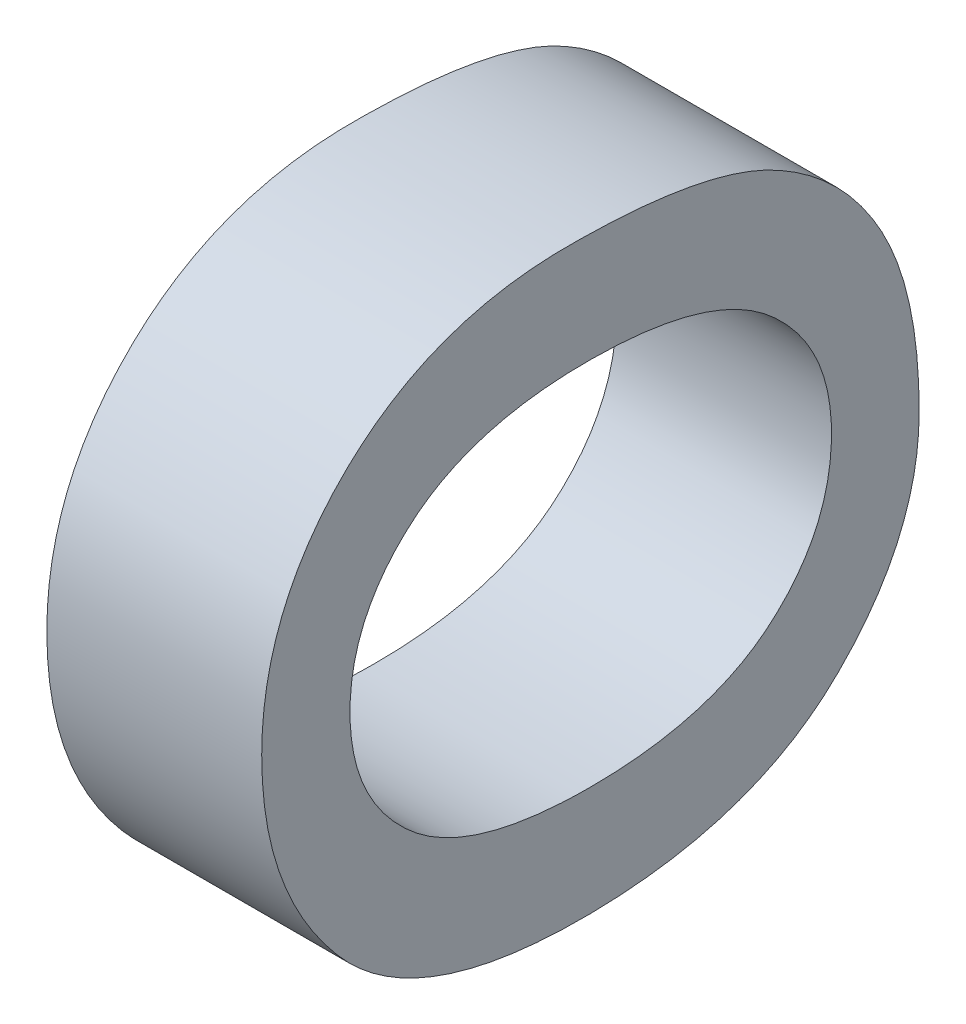
ISO-10303-21;
HEADER;
FILE_DESCRIPTION(('STEP AP214'),'2;1');
FILE_NAME('part.step','',(''),(''),'','','');
FILE_SCHEMA(('AUTOMOTIVE_DESIGN { 1 0 10303 214 1 1 1 1 }'));
ENDSEC;
DATA;
#1=APPLICATION_CONTEXT('core data for automotive mechanical design processes');
#2=APPLICATION_PROTOCOL_DEFINITION('international standard','automotive_design',2000,#1);
#3=PRODUCT_CONTEXT('',#1,'mechanical');
#4=PRODUCT('Part','Part','',(#3));
#5=PRODUCT_RELATED_PRODUCT_CATEGORY('part','',(#4));
#6=PRODUCT_DEFINITION_FORMATION('','',#4);
#7=PRODUCT_DEFINITION_CONTEXT('part definition',#1,'design');
#8=PRODUCT_DEFINITION('design','',#6,#7);
#9=PRODUCT_DEFINITION_SHAPE('','',#8);
#10=(LENGTH_UNIT() NAMED_UNIT(*) SI_UNIT(.MILLI.,.METRE.));
#11=(NAMED_UNIT(*) PLANE_ANGLE_UNIT() SI_UNIT($,.RADIAN.));
#12=(NAMED_UNIT(*) SI_UNIT($,.STERADIAN.) SOLID_ANGLE_UNIT());
#13=UNCERTAINTY_MEASURE_WITH_UNIT(LENGTH_MEASURE(1.E-05),#10,'distance_accuracy_value','');
#14=(GEOMETRIC_REPRESENTATION_CONTEXT(3) GLOBAL_UNCERTAINTY_ASSIGNED_CONTEXT((#13)) GLOBAL_UNIT_ASSIGNED_CONTEXT((#10,
#11,#12)) REPRESENTATION_CONTEXT('',''));
#15=CARTESIAN_POINT('',(0.,0.,0.));
#16=DIRECTION('',(0.,0.,1.));
#17=DIRECTION('',(1.,0.,0.));
#18=AXIS2_PLACEMENT_3D('',#15,#16,#17);
#19=CARTESIAN_POINT('',(4.55229940712905,-38.7923037867198,-8.87455840971013));
#20=DIRECTION('',(-1.,0.,0.));
#21=DIRECTION('',(0.,0.,1.));
#22=AXIS2_PLACEMENT_3D('',#19,#20,#21);
#23=PLANE('',#22);
#24=CARTESIAN_POINT('',(4.55229940712904,-38.7070234674718,-9.06579306499374));
#25=CARTESIAN_POINT('',(4.55229940712904,-38.7070234674718,-9.1220263906555));
#26=CARTESIAN_POINT('',(4.55229940712904,-38.682490300884,-9.15000522670781));
#27=CARTESIAN_POINT('',(4.55229940712904,-38.6579571342963,-9.17798406276011));
#28=CARTESIAN_POINT('',(4.55229940712903,-38.6207439040789,-9.17798406276011));
#29=CARTESIAN_POINT('',(4.55229940712903,-38.5838063274188,-9.17798406276011));
#30=CARTESIAN_POINT('',(4.55229940712902,-38.559273160831,-9.14986739992922));
#31=CARTESIAN_POINT('',(4.55229940712902,-38.5347399942433,-9.12175073709834));
#32=CARTESIAN_POINT('',(4.55229940712902,-38.5347399942433,-9.06413914365074));
#33=CARTESIAN_POINT('',(4.55229940712902,-38.5347399942433,-9.00983539288913));
#34=CARTESIAN_POINT('',(4.55229940712902,-38.5594109876096,-8.98185655683683));
#35=CARTESIAN_POINT('',(4.55229940712903,-38.5840819809759,-8.95387772078453));
#36=CARTESIAN_POINT('',(4.55229940712903,-38.6207439040789,-8.95387772078453));
#37=CARTESIAN_POINT('',(4.55229940712904,-38.6579571342963,-8.95387772078453));
#38=CARTESIAN_POINT('',(4.55229940712904,-38.682490300884,-8.98171873005825));
#39=CARTESIAN_POINT('',(4.55229940712904,-38.7070234674718,-9.00955973933197));
#40=CARTESIAN_POINT('',(4.55229940712904,-38.7070234674718,-9.06579306499374));
#41=(BOUNDED_CURVE() B_SPLINE_CURVE(2,(#24,#25,#26,#27,#28,#29,#30,#31,#32,#33,#34,#35,#36,#37,
#38,#39,#40),.UNSPECIFIED.,.T.,.F.) B_SPLINE_CURVE_WITH_KNOTS((3,2,2,2,2,2,2,2,3),(9.,10.,11.,
12.,13.,14.,15.,16.,17.),
.UNSPECIFIED.) CURVE() GEOMETRIC_REPRESENTATION_ITEM() RATIONAL_B_SPLINE_CURVE((1.,1.,1.,1.,1.,
1.,1.,1.,1.,1.,1.,1.,1.,1.,1.,1.,1.)) REPRESENTATION_ITEM(''));
#42=CARTESIAN_POINT('',(4.55229940712904,-38.7070234674718,-9.06579306499374));
#43=VERTEX_POINT('',#42);
#44=EDGE_CURVE('E11',#43,#43,#41,.T.);
#45=ORIENTED_EDGE('',*,*,#44,.T.);
#46=EDGE_LOOP('',(#45));
#47=FACE_BOUND('',#46,.T.);
#48=CARTESIAN_POINT('',(4.55229940712905,-38.7580193755474,-9.06220956875058));
#49=CARTESIAN_POINT('',(4.55229940712905,-38.7580193755474,-8.9844752656299));
#50=CARTESIAN_POINT('',(4.55229940712904,-38.6750476548406,-8.91280534076686));
#51=CARTESIAN_POINT('',(4.55229940712902,-38.5603757750597,-8.91280534076686));
#52=CARTESIAN_POINT('',(4.55229940712901,-38.4837440861677,-8.99191791167337));
#53=CARTESIAN_POINT('',(4.55229940712901,-38.4837440861677,-9.11816724085519));
#54=CARTESIAN_POINT('',(4.55229940712902,-38.517649473699,-9.18294582678909));
#55=CARTESIAN_POINT('',(4.55229940712903,-38.582428059633,-9.21878078922061));
#56=CARTESIAN_POINT('',(4.55229940712904,-38.6822146473269,-9.21878078922061));
#57=CARTESIAN_POINT('',(4.55229940712905,-38.7580193755474,-9.13994387187126));
#58=CARTESIAN_POINT('',(4.55229940712905,-38.7580193755474,-9.06220956875058));
#59=(BOUNDED_CURVE() B_SPLINE_CURVE(2,(#48,#49,#50,#51,#52,#53,#54,#55,#56,#57,#58),
.UNSPECIFIED.,.T.,.F.) B_SPLINE_CURVE_WITH_KNOTS((3,1,1,1,1,1,1,1,1,3),(0.,1.,2.,3.,4.,5.,6.,7.,
8.,9.),.UNSPECIFIED.) CURVE() GEOMETRIC_REPRESENTATION_ITEM() RATIONAL_B_SPLINE_CURVE((1.,1.,1.,
1.,1.,1.,1.,1.,1.,1.,1.)) REPRESENTATION_ITEM(''));
#60=CARTESIAN_POINT('',(4.55229940712905,-38.7580193755474,-9.06579306499374));
#61=VERTEX_POINT('',#60);
#62=EDGE_CURVE('E57',#61,#61,#59,.T.);
#63=ORIENTED_EDGE('',*,*,#62,.T.);
#64=EDGE_LOOP('',(#63));
#65=FACE_BOUND('',#64,.T.);
#66=ADVANCED_FACE('F16',(#47,#65),#23,.T.);
#67=CARTESIAN_POINT('',(4.65229940712906,-38.7923037867198,-8.87455840971013));
#68=DIRECTION('',(1.,0.,0.));
#69=DIRECTION('',(0.,1.,0.));
#70=AXIS2_PLACEMENT_3D('',#67,#68,#69);
#71=PLANE('',#70);
#72=CARTESIAN_POINT('',(4.65229940712905,-38.7070234674717,-9.06579306499374));
#73=CARTESIAN_POINT('',(4.65229940712905,-38.7070234674717,-9.1220263906555));
#74=CARTESIAN_POINT('',(4.65229940712904,-38.682490300884,-9.15000522670781));
#75=CARTESIAN_POINT('',(4.65229940712904,-38.6579571342963,-9.17798406276011));
#76=CARTESIAN_POINT('',(4.65229940712903,-38.6207439040789,-9.17798406276011));
#77=CARTESIAN_POINT('',(4.65229940712903,-38.5838063274188,-9.17798406276011));
#78=CARTESIAN_POINT('',(4.65229940712903,-38.559273160831,-9.14986739992922));
#79=CARTESIAN_POINT('',(4.65229940712902,-38.5347399942433,-9.12175073709834));
#80=CARTESIAN_POINT('',(4.65229940712902,-38.5347399942433,-9.06413914365075));
#81=CARTESIAN_POINT('',(4.65229940712902,-38.5347399942433,-9.00983539288913));
#82=CARTESIAN_POINT('',(4.65229940712902,-38.5594109876096,-8.98185655683683));
#83=CARTESIAN_POINT('',(4.65229940712903,-38.5840819809759,-8.95387772078453));
#84=CARTESIAN_POINT('',(4.65229940712903,-38.6207439040789,-8.95387772078453));
#85=CARTESIAN_POINT('',(4.65229940712904,-38.6579571342963,-8.95387772078453));
#86=CARTESIAN_POINT('',(4.65229940712904,-38.682490300884,-8.98171873005825));
#87=CARTESIAN_POINT('',(4.65229940712904,-38.7070234674717,-9.00955973933197));
#88=CARTESIAN_POINT('',(4.65229940712905,-38.7070234674717,-9.06579306499374));
#89=(BOUNDED_CURVE() B_SPLINE_CURVE(2,(#72,#73,#74,#75,#76,#77,#78,#79,#80,#81,#82,#83,#84,#85,
#86,#87,#88),.UNSPECIFIED.,.T.,.F.) B_SPLINE_CURVE_WITH_KNOTS((3,2,2,2,2,2,2,2,3),(9.,10.,11.,
12.,13.,14.,15.,16.,17.),
.UNSPECIFIED.) CURVE() GEOMETRIC_REPRESENTATION_ITEM() RATIONAL_B_SPLINE_CURVE((1.,1.,1.,1.,1.,
1.,1.,1.,1.,1.,1.,1.,1.,1.,1.,1.,1.)) REPRESENTATION_ITEM(''));
#90=CARTESIAN_POINT('',(4.65229940712905,-38.7070234674717,-9.06579306499374));
#91=VERTEX_POINT('',#90);
#92=EDGE_CURVE('E59',#91,#91,#89,.T.);
#93=ORIENTED_EDGE('',*,*,#92,.F.);
#94=EDGE_LOOP('',(#93));
#95=FACE_BOUND('',#94,.T.);
#96=CARTESIAN_POINT('',(4.65229940712905,-38.7580193755474,-9.06220956875059));
#97=CARTESIAN_POINT('',(4.65229940712905,-38.7580193755474,-8.9844752656299));
#98=CARTESIAN_POINT('',(4.65229940712904,-38.6750476548405,-8.91280534076686));
#99=CARTESIAN_POINT('',(4.65229940712902,-38.5603757750597,-8.91280534076686));
#100=CARTESIAN_POINT('',(4.65229940712901,-38.4837440861677,-8.99191791167338));
#101=CARTESIAN_POINT('',(4.65229940712901,-38.4837440861677,-9.11816724085519));
#102=CARTESIAN_POINT('',(4.65229940712902,-38.517649473699,-9.18294582678909));
#103=CARTESIAN_POINT('',(4.65229940712903,-38.5824280596329,-9.21878078922061));
#104=CARTESIAN_POINT('',(4.65229940712904,-38.6822146473268,-9.21878078922061));
#105=CARTESIAN_POINT('',(4.65229940712905,-38.7580193755474,-9.13994387187127));
#106=CARTESIAN_POINT('',(4.65229940712905,-38.7580193755474,-9.06220956875059));
#107=(BOUNDED_CURVE() B_SPLINE_CURVE(2,(#96,#97,#98,#99,#100,#101,#102,#103,#104,#105,#106),
.UNSPECIFIED.,.T.,.F.) B_SPLINE_CURVE_WITH_KNOTS((3,1,1,1,1,1,1,1,1,3),(0.,1.,2.,3.,4.,5.,6.,7.,
8.,9.),.UNSPECIFIED.) CURVE() GEOMETRIC_REPRESENTATION_ITEM() RATIONAL_B_SPLINE_CURVE((1.,1.,1.,
1.,1.,1.,1.,1.,1.,1.,1.)) REPRESENTATION_ITEM(''));
#108=CARTESIAN_POINT('',(4.65229940712905,-38.7580193755474,-9.06579306499374));
#109=VERTEX_POINT('',#108);
#110=EDGE_CURVE('E66',#109,#109,#107,.T.);
#111=ORIENTED_EDGE('',*,*,#110,.F.);
#112=EDGE_LOOP('',(#111));
#113=FACE_BOUND('',#112,.T.);
#114=ADVANCED_FACE('F97',(#95,#113),#71,.T.);
#115=CARTESIAN_POINT('',(4.65229940712905,-38.7070234674717,-9.06579306499374));
#116=CARTESIAN_POINT('',(4.55229940712904,-38.7070234674718,-9.06579306499374));
#117=CARTESIAN_POINT('',(4.65229940712905,-38.7070234674717,-9.1220263906555));
#118=CARTESIAN_POINT('',(4.55229940712904,-38.7070234674718,-9.1220263906555));
#119=CARTESIAN_POINT('',(4.65229940712904,-38.682490300884,-9.15000522670781));
#120=CARTESIAN_POINT('',(4.55229940712904,-38.682490300884,-9.15000522670781));
#121=CARTESIAN_POINT('',(4.65229940712904,-38.6579571342963,-9.17798406276011));
#122=CARTESIAN_POINT('',(4.55229940712904,-38.6579571342963,-9.17798406276011));
#123=CARTESIAN_POINT('',(4.65229940712903,-38.6207439040789,-9.17798406276011));
#124=CARTESIAN_POINT('',(4.55229940712903,-38.6207439040789,-9.17798406276011));
#125=CARTESIAN_POINT('',(4.65229940712903,-38.5838063274188,-9.17798406276011));
#126=CARTESIAN_POINT('',(4.55229940712903,-38.5838063274188,-9.17798406276011));
#127=CARTESIAN_POINT('',(4.65229940712903,-38.559273160831,-9.14986739992922));
#128=CARTESIAN_POINT('',(4.55229940712902,-38.559273160831,-9.14986739992922));
#129=CARTESIAN_POINT('',(4.65229940712902,-38.5347399942433,-9.12175073709834));
#130=CARTESIAN_POINT('',(4.55229940712902,-38.5347399942433,-9.12175073709834));
#131=CARTESIAN_POINT('',(4.65229940712902,-38.5347399942433,-9.06413914365075));
#132=CARTESIAN_POINT('',(4.55229940712902,-38.5347399942433,-9.06413914365074));
#133=CARTESIAN_POINT('',(4.65229940712902,-38.5347399942433,-9.00983539288913));
#134=CARTESIAN_POINT('',(4.55229940712902,-38.5347399942433,-9.00983539288913));
#135=CARTESIAN_POINT('',(4.65229940712902,-38.5594109876096,-8.98185655683683));
#136=CARTESIAN_POINT('',(4.55229940712902,-38.5594109876096,-8.98185655683683));
#137=CARTESIAN_POINT('',(4.65229940712903,-38.5840819809759,-8.95387772078453));
#138=CARTESIAN_POINT('',(4.55229940712903,-38.5840819809759,-8.95387772078453));
#139=CARTESIAN_POINT('',(4.65229940712903,-38.6207439040789,-8.95387772078453));
#140=CARTESIAN_POINT('',(4.55229940712903,-38.6207439040789,-8.95387772078453));
#141=CARTESIAN_POINT('',(4.65229940712904,-38.6579571342963,-8.95387772078453));
#142=CARTESIAN_POINT('',(4.55229940712904,-38.6579571342963,-8.95387772078453));
#143=CARTESIAN_POINT('',(4.65229940712904,-38.682490300884,-8.98171873005825));
#144=CARTESIAN_POINT('',(4.55229940712904,-38.682490300884,-8.98171873005825));
#145=CARTESIAN_POINT('',(4.65229940712904,-38.7070234674717,-9.00955973933197));
#146=CARTESIAN_POINT('',(4.55229940712904,-38.7070234674718,-9.00955973933197));
#147=CARTESIAN_POINT('',(4.65229940712905,-38.7070234674717,-9.06579306499374));
#148=CARTESIAN_POINT('',(4.55229940712904,-38.7070234674718,-9.06579306499374));
#149=(BOUNDED_SURFACE() B_SPLINE_SURFACE(2,1,((#115,#116),(#117,#118),(#119,#120),(#121,#122),
(#123,#124),(#125,#126),(#127,#128),(#129,#130),(#131,#132),(#133,#134),(#135,#136),(#137,#138),
(#139,#140),(#141,#142),(#143,#144),(#145,#146),(#147,#148)),.UNSPECIFIED.,.T.,.F.,
.F.) B_SPLINE_SURFACE_WITH_KNOTS((3,2,2,2,2,2,2,2,3),(2,2),(9.,10.,11.,12.,13.,14.,15.,16.,17.),
(0.,0.1),.UNSPECIFIED.) GEOMETRIC_REPRESENTATION_ITEM() RATIONAL_B_SPLINE_SURFACE(((1.,1.),(1.,
1.),(1.,1.),(1.,1.),(1.,1.),(1.,1.),(1.,1.),(1.,1.),(1.,1.),(1.,1.),(1.,1.),(1.,1.),(1.,1.),(1.,
1.),(1.,1.),(1.,1.),(1.,1.))) REPRESENTATION_ITEM('') SURFACE());
#150=CARTESIAN_POINT('',(4.65229940712905,-38.7070234674717,-9.06579306499374));
#151=CARTESIAN_POINT('',(4.55229940712904,-38.7070234674718,-9.06579306499374));
#152=(BOUNDED_CURVE() B_SPLINE_CURVE(1,(#150,#151),.UNSPECIFIED.,.F.,
.F.) B_SPLINE_CURVE_WITH_KNOTS((2,2),(0.,0.1),
.UNSPECIFIED.) CURVE() GEOMETRIC_REPRESENTATION_ITEM() RATIONAL_B_SPLINE_CURVE((1.,1.)) REPRESENTATION_ITEM(''));
#153=EDGE_CURVE('E31',#91,#43,#152,.T.);
#154=ORIENTED_EDGE('',*,*,#92,.T.);
#155=ORIENTED_EDGE('',*,*,#153,.T.);
#156=ORIENTED_EDGE('',*,*,#44,.F.);
#157=ORIENTED_EDGE('',*,*,#153,.F.);
#158=EDGE_LOOP('',(#154,#155,#156,#157));
#159=FACE_BOUND('',#158,.T.);
#160=ADVANCED_FACE('F99',(#159),#149,.T.);
#161=CARTESIAN_POINT('',(4.65229940712905,-38.7580193755474,-9.06220956875059));
#162=CARTESIAN_POINT('',(4.55229940712905,-38.7580193755474,-9.06220956875058));
#163=CARTESIAN_POINT('',(4.65229940712905,-38.7580193755474,-8.9844752656299));
#164=CARTESIAN_POINT('',(4.55229940712905,-38.7580193755474,-8.9844752656299));
#165=CARTESIAN_POINT('',(4.65229940712904,-38.6750476548405,-8.91280534076686));
#166=CARTESIAN_POINT('',(4.55229940712904,-38.6750476548406,-8.91280534076686));
#167=CARTESIAN_POINT('',(4.65229940712902,-38.5603757750597,-8.91280534076686));
#168=CARTESIAN_POINT('',(4.55229940712902,-38.5603757750597,-8.91280534076686));
#169=CARTESIAN_POINT('',(4.65229940712901,-38.4837440861677,-8.99191791167338));
#170=CARTESIAN_POINT('',(4.55229940712901,-38.4837440861677,-8.99191791167337));
#171=CARTESIAN_POINT('',(4.65229940712901,-38.4837440861677,-9.11816724085519));
#172=CARTESIAN_POINT('',(4.55229940712901,-38.4837440861677,-9.11816724085519));
#173=CARTESIAN_POINT('',(4.65229940712902,-38.517649473699,-9.18294582678909));
#174=CARTESIAN_POINT('',(4.55229940712902,-38.517649473699,-9.18294582678909));
#175=CARTESIAN_POINT('',(4.65229940712903,-38.5824280596329,-9.21878078922061));
#176=CARTESIAN_POINT('',(4.55229940712903,-38.582428059633,-9.21878078922061));
#177=CARTESIAN_POINT('',(4.65229940712904,-38.6822146473268,-9.21878078922061));
#178=CARTESIAN_POINT('',(4.55229940712904,-38.6822146473269,-9.21878078922061));
#179=CARTESIAN_POINT('',(4.65229940712905,-38.7580193755474,-9.13994387187127));
#180=CARTESIAN_POINT('',(4.55229940712905,-38.7580193755474,-9.13994387187126));
#181=CARTESIAN_POINT('',(4.65229940712905,-38.7580193755474,-9.06220956875059));
#182=CARTESIAN_POINT('',(4.55229940712905,-38.7580193755474,-9.06220956875058));
#183=(BOUNDED_SURFACE() B_SPLINE_SURFACE(2,1,((#161,#162),(#163,#164),(#165,#166),(#167,#168),
(#169,#170),(#171,#172),(#173,#174),(#175,#176),(#177,#178),(#179,#180),(#181,#182)),
.UNSPECIFIED.,.T.,.F.,.F.) B_SPLINE_SURFACE_WITH_KNOTS((3,1,1,1,1,1,1,1,1,3),(2,2),(0.,1.,2.,3.,
4.,5.,6.,7.,8.,9.),(0.,0.1),
.UNSPECIFIED.) GEOMETRIC_REPRESENTATION_ITEM() RATIONAL_B_SPLINE_SURFACE(((1.,1.),(1.,1.),(1.,
1.),(1.,1.),(1.,1.),(1.,1.),(1.,1.),(1.,1.),(1.,1.),(1.,1.),(1.,1.))) REPRESENTATION_ITEM('') SURFACE());
#184=CARTESIAN_POINT('',(4.65229940712905,-38.7579990091234,-9.06579283213992));
#185=CARTESIAN_POINT('',(4.55229940712905,-38.7579990091234,-9.06579283213991));
#186=(BOUNDED_CURVE() B_SPLINE_CURVE(1,(#184,#185),.UNSPECIFIED.,.F.,
.F.) B_SPLINE_CURVE_WITH_KNOTS((2,2),(0.,0.1),
.UNSPECIFIED.) CURVE() GEOMETRIC_REPRESENTATION_ITEM() RATIONAL_B_SPLINE_CURVE((1.,1.)) REPRESENTATION_ITEM(''));
#187=EDGE_CURVE('E52',#109,#61,#186,.T.);
#188=ORIENTED_EDGE('',*,*,#110,.T.);
#189=ORIENTED_EDGE('',*,*,#187,.T.);
#190=ORIENTED_EDGE('',*,*,#62,.F.);
#191=ORIENTED_EDGE('',*,*,#187,.F.);
#192=EDGE_LOOP('',(#188,#189,#190,#191));
#193=FACE_BOUND('',#192,.T.);
#194=ADVANCED_FACE('F18',(#193),#183,.T.);
#195=CLOSED_SHELL('',(#66,#114,#160,#194));
#196=MANIFOLD_SOLID_BREP('B1',#195);
#197=ADVANCED_BREP_SHAPE_REPRESENTATION('',(#18,#196),#14);
#198=SHAPE_DEFINITION_REPRESENTATION(#9,#197);
ENDSEC;
END-ISO-10303-21;
